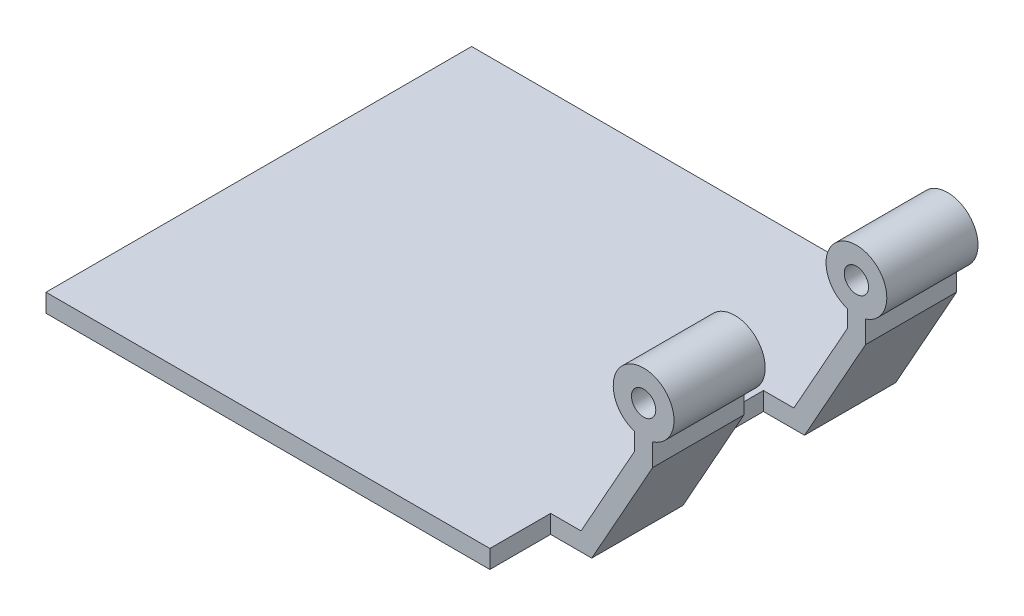
ISO-10303-21;
HEADER;
FILE_DESCRIPTION(('STEP AP214'),'2;1');
FILE_NAME('part.step','',(''),(''),'','','');
FILE_SCHEMA(('AUTOMOTIVE_DESIGN { 1 0 10303 214 1 1 1 1 }'));
ENDSEC;
DATA;
#1=APPLICATION_CONTEXT('core data for automotive mechanical design processes');
#2=APPLICATION_PROTOCOL_DEFINITION('international standard','automotive_design',2000,#1);
#3=PRODUCT_CONTEXT('',#1,'mechanical');
#4=PRODUCT('Part','Part','',(#3));
#5=PRODUCT_RELATED_PRODUCT_CATEGORY('part','',(#4));
#6=PRODUCT_DEFINITION_FORMATION('','',#4);
#7=PRODUCT_DEFINITION_CONTEXT('part definition',#1,'design');
#8=PRODUCT_DEFINITION('design','',#6,#7);
#9=PRODUCT_DEFINITION_SHAPE('','',#8);
#10=(LENGTH_UNIT() NAMED_UNIT(*) SI_UNIT(.MILLI.,.METRE.));
#11=(NAMED_UNIT(*) PLANE_ANGLE_UNIT() SI_UNIT($,.RADIAN.));
#12=(NAMED_UNIT(*) SI_UNIT($,.STERADIAN.) SOLID_ANGLE_UNIT());
#13=UNCERTAINTY_MEASURE_WITH_UNIT(LENGTH_MEASURE(1.E-05),#10,'distance_accuracy_value','');
#14=(GEOMETRIC_REPRESENTATION_CONTEXT(3) GLOBAL_UNCERTAINTY_ASSIGNED_CONTEXT((#13)) GLOBAL_UNIT_ASSIGNED_CONTEXT((#10,
#11,#12)) REPRESENTATION_CONTEXT('',''));
#15=CARTESIAN_POINT('',(0.,0.,0.));
#16=DIRECTION('',(0.,0.,1.));
#17=DIRECTION('',(1.,0.,0.));
#18=AXIS2_PLACEMENT_3D('',#15,#16,#17);
#19=CARTESIAN_POINT('',(90.2917408136151,26.3526404117387,50.));
#20=DIRECTION('',(0.,0.,-1.));
#21=DIRECTION('',(-1.,0.,0.));
#22=AXIS2_PLACEMENT_3D('',#19,#20,#21);
#23=CYLINDRICAL_SURFACE('',#22,5.);
#24=CARTESIAN_POINT('',(90.2917408136151,26.3526404117387,15.));
#25=DIRECTION('',(0.,0.,1.));
#26=DIRECTION('',(0.,-1.,0.));
#27=AXIS2_PLACEMENT_3D('',#24,#25,#26);
#28=CIRCLE('',#27,5.);
#29=CARTESIAN_POINT('',(91.7917408136151,21.582944404654,15.));
#30=VERTEX_POINT('',#29);
#31=CARTESIAN_POINT('',(88.7917408136151,21.582944404654,15.));
#32=VERTEX_POINT('',#31);
#33=EDGE_CURVE('E271',#30,#32,#28,.T.);
#34=ORIENTED_EDGE('',*,*,#33,.F.);
#35=DIRECTION('',(0.,0.,-1.));
#36=VECTOR('',#35,1.);
#37=CARTESIAN_POINT('',(91.7917408136151,21.582944404654,50.));
#38=LINE('',#37,#36);
#39=CARTESIAN_POINT('',(91.7917408136151,21.582944404654,0.));
#40=VERTEX_POINT('',#39);
#41=EDGE_CURVE('E355',#30,#40,#38,.T.);
#42=ORIENTED_EDGE('',*,*,#41,.T.);
#43=CARTESIAN_POINT('',(90.2917408136151,26.3526404117387,0.));
#44=DIRECTION('',(0.,0.,1.));
#45=DIRECTION('',(1.,0.,0.));
#46=AXIS2_PLACEMENT_3D('',#43,#44,#45);
#47=CIRCLE('',#46,5.);
#48=CARTESIAN_POINT('',(88.7917408136151,21.582944404654,0.));
#49=VERTEX_POINT('',#48);
#50=EDGE_CURVE('E299',#40,#49,#47,.T.);
#51=ORIENTED_EDGE('',*,*,#50,.T.);
#52=DIRECTION('',(0.,0.,-1.));
#53=VECTOR('',#52,1.);
#54=CARTESIAN_POINT('',(88.7917408136151,21.582944404654,50.));
#55=LINE('',#54,#53);
#56=EDGE_CURVE('E350',#32,#49,#55,.T.);
#57=ORIENTED_EDGE('',*,*,#56,.F.);
#58=EDGE_LOOP('',(#34,#42,#51,#57));
#59=FACE_BOUND('',#58,.T.);
#60=ADVANCED_FACE('F62',(#59),#23,.T.);
#61=CARTESIAN_POINT('',(90.2917408136151,26.3526404117387,35.));
#62=DIRECTION('',(0.,0.,-1.));
#63=DIRECTION('',(0.,1.,0.));
#64=AXIS2_PLACEMENT_3D('',#61,#62,#63);
#65=CIRCLE('',#64,5.);
#66=CARTESIAN_POINT('',(88.7917408136151,21.582944404654,35.));
#67=VERTEX_POINT('',#66);
#68=CARTESIAN_POINT('',(91.7917408136151,21.582944404654,35.));
#69=VERTEX_POINT('',#68);
#70=EDGE_CURVE('E285',#67,#69,#65,.T.);
#71=ORIENTED_EDGE('',*,*,#70,.F.);
#72=CARTESIAN_POINT('',(88.7917408136151,21.582944404654,50.));
#73=VERTEX_POINT('',#72);
#74=EDGE_CURVE('E76',#73,#67,#55,.T.);
#75=ORIENTED_EDGE('',*,*,#74,.F.);
#76=CARTESIAN_POINT('',(90.2917408136151,26.3526404117387,50.));
#77=DIRECTION('',(0.,0.,1.));
#78=DIRECTION('',(1.,0.,0.));
#79=AXIS2_PLACEMENT_3D('',#76,#77,#78);
#80=CIRCLE('',#79,5.);
#81=CARTESIAN_POINT('',(91.7917408136151,21.582944404654,50.));
#82=VERTEX_POINT('',#81);
#83=EDGE_CURVE('E322',#82,#73,#80,.T.);
#84=ORIENTED_EDGE('',*,*,#83,.F.);
#85=EDGE_CURVE('E69',#82,#69,#38,.T.);
#86=ORIENTED_EDGE('',*,*,#85,.T.);
#87=EDGE_LOOP('',(#71,#75,#84,#86));
#88=FACE_BOUND('',#87,.T.);
#89=ADVANCED_FACE('F364',(#88),#23,.T.);
#90=CARTESIAN_POINT('',(110.015744072677,30.0086373562634,35.));
#91=DIRECTION('',(0.,0.,-1.));
#92=DIRECTION('',(0.,1.,0.));
#93=AXIS2_PLACEMENT_3D('',#90,#91,#92);
#94=PLANE('',#93);
#95=DIRECTION('',(-0.488430045200838,-0.872603054627422,0.));
#96=VECTOR('',#95,1.);
#97=CARTESIAN_POINT('',(81.7587720513456,0.,35.));
#98=LINE('',#97,#96);
#99=CARTESIAN_POINT('',(91.7917408136151,17.9243666006214,35.));
#100=VERTEX_POINT('',#99);
#101=CARTESIAN_POINT('',(81.7587720513456,0.,35.));
#102=VERTEX_POINT('',#101);
#103=EDGE_CURVE('E217',#100,#102,#98,.T.);
#104=ORIENTED_EDGE('',*,*,#103,.T.);
#105=DIRECTION('',(1.,0.,0.));
#106=VECTOR('',#105,1.);
#107=CARTESIAN_POINT('',(75.,0.,35.));
#108=LINE('',#107,#106);
#109=CARTESIAN_POINT('',(75.,0.,35.));
#110=VERTEX_POINT('',#109);
#111=EDGE_CURVE('E213',#110,#102,#108,.T.);
#112=ORIENTED_EDGE('',*,*,#111,.F.);
#113=DIRECTION('',(0.,1.,0.));
#114=VECTOR('',#113,1.);
#115=CARTESIAN_POINT('',(75.,0.,35.));
#116=LINE('',#115,#114);
#117=CARTESIAN_POINT('',(75.,3.,35.));
#118=VERTEX_POINT('',#117);
#119=EDGE_CURVE('E198',#110,#118,#116,.T.);
#120=ORIENTED_EDGE('',*,*,#119,.T.);
#121=DIRECTION('',(1.,0.,0.));
#122=VECTOR('',#121,1.);
#123=CARTESIAN_POINT('',(75.,3.,35.));
#124=LINE('',#123,#122);
#125=CARTESIAN_POINT('',(80.,3.,35.));
#126=VERTEX_POINT('',#125);
#127=EDGE_CURVE('E226',#118,#126,#124,.T.);
#128=ORIENTED_EDGE('',*,*,#127,.T.);
#129=DIRECTION('',(0.488430045200838,0.872603054627422,0.));
#130=VECTOR('',#129,1.);
#131=CARTESIAN_POINT('',(88.7917408136151,18.7068549832936,35.));
#132=LINE('',#131,#130);
#133=CARTESIAN_POINT('',(88.7917408136151,18.7068549832936,35.));
#134=VERTEX_POINT('',#133);
#135=EDGE_CURVE('E288',#126,#134,#132,.T.);
#136=ORIENTED_EDGE('',*,*,#135,.T.);
#137=DIRECTION('',(0.,-1.,0.));
#138=VECTOR('',#137,1.);
#139=CARTESIAN_POINT('',(88.7917408136151,18.7068549832936,35.));
#140=LINE('',#139,#138);
#141=EDGE_CURVE('E289',#67,#134,#140,.T.);
#142=ORIENTED_EDGE('',*,*,#141,.F.);
#143=ORIENTED_EDGE('',*,*,#70,.T.);
#144=DIRECTION('',(0.,-1.,0.));
#145=VECTOR('',#144,1.);
#146=CARTESIAN_POINT('',(91.7917408136151,17.9243666006214,35.));
#147=LINE('',#146,#145);
#148=EDGE_CURVE('E287',#69,#100,#147,.T.);
#149=ORIENTED_EDGE('',*,*,#148,.T.);
#150=EDGE_LOOP('',(#104,#112,#120,#128,#136,#142,#143,#149));
#151=FACE_BOUND('',#150,.T.);
#152=CARTESIAN_POINT('',(90.2917408136151,26.3526404117387,35.));
#153=DIRECTION('',(0.,0.,-1.));
#154=DIRECTION('',(0.,1.,0.));
#155=AXIS2_PLACEMENT_3D('',#152,#153,#154);
#156=CIRCLE('',#155,2.);
#157=CARTESIAN_POINT('',(90.2917408136151,28.3526404117387,35.));
#158=VERTEX_POINT('',#157);
#159=EDGE_CURVE('E284',#158,#158,#156,.T.);
#160=ORIENTED_EDGE('',*,*,#159,.F.);
#161=EDGE_LOOP('',(#160));
#162=FACE_BOUND('',#161,.T.);
#163=ADVANCED_FACE('F214',(#151,#162),#94,.T.);
#164=CARTESIAN_POINT('',(110.015744072677,30.0086373562634,15.));
#165=DIRECTION('',(0.,0.,1.));
#166=DIRECTION('',(0.,-1.,0.));
#167=AXIS2_PLACEMENT_3D('',#164,#165,#166);
#168=PLANE('',#167);
#169=DIRECTION('',(-1.,0.,0.));
#170=VECTOR('',#169,1.);
#171=CARTESIAN_POINT('',(75.,0.,15.));
#172=LINE('',#171,#170);
#173=CARTESIAN_POINT('',(81.7587720513456,0.,15.));
#174=VERTEX_POINT('',#173);
#175=CARTESIAN_POINT('',(75.,0.,15.));
#176=VERTEX_POINT('',#175);
#177=EDGE_CURVE('E210',#174,#176,#172,.T.);
#178=ORIENTED_EDGE('',*,*,#177,.F.);
#179=DIRECTION('',(0.488430045200838,0.872603054627422,0.));
#180=VECTOR('',#179,1.);
#181=CARTESIAN_POINT('',(81.7587720513456,0.,15.));
#182=LINE('',#181,#180);
#183=CARTESIAN_POINT('',(91.7917408136151,17.9243666006214,15.));
#184=VERTEX_POINT('',#183);
#185=EDGE_CURVE('E274',#174,#184,#182,.T.);
#186=ORIENTED_EDGE('',*,*,#185,.T.);
#187=DIRECTION('',(0.,1.,0.));
#188=VECTOR('',#187,1.);
#189=CARTESIAN_POINT('',(91.7917408136151,17.9243666006214,15.));
#190=LINE('',#189,#188);
#191=EDGE_CURVE('E275',#184,#30,#190,.T.);
#192=ORIENTED_EDGE('',*,*,#191,.T.);
#193=ORIENTED_EDGE('',*,*,#33,.T.);
#194=DIRECTION('',(0.,1.,0.));
#195=VECTOR('',#194,1.);
#196=CARTESIAN_POINT('',(88.7917408136151,18.7068549832936,15.));
#197=LINE('',#196,#195);
#198=CARTESIAN_POINT('',(88.7917408136151,18.7068549832936,15.));
#199=VERTEX_POINT('',#198);
#200=EDGE_CURVE('E273',#199,#32,#197,.T.);
#201=ORIENTED_EDGE('',*,*,#200,.F.);
#202=DIRECTION('',(-0.488430045200838,-0.872603054627422,0.));
#203=VECTOR('',#202,1.);
#204=CARTESIAN_POINT('',(88.7917408136151,18.7068549832936,15.));
#205=LINE('',#204,#203);
#206=CARTESIAN_POINT('',(80.,3.,15.));
#207=VERTEX_POINT('',#206);
#208=EDGE_CURVE('E281',#199,#207,#205,.T.);
#209=ORIENTED_EDGE('',*,*,#208,.T.);
#210=DIRECTION('',(-1.,0.,0.));
#211=VECTOR('',#210,1.);
#212=CARTESIAN_POINT('',(75.,3.,15.));
#213=LINE('',#212,#211);
#214=CARTESIAN_POINT('',(75.,3.,15.));
#215=VERTEX_POINT('',#214);
#216=EDGE_CURVE('E224',#207,#215,#213,.T.);
#217=ORIENTED_EDGE('',*,*,#216,.T.);
#218=DIRECTION('',(0.,1.,0.));
#219=VECTOR('',#218,1.);
#220=CARTESIAN_POINT('',(75.,0.,15.));
#221=LINE('',#220,#219);
#222=EDGE_CURVE('E209',#176,#215,#221,.T.);
#223=ORIENTED_EDGE('',*,*,#222,.F.);
#224=EDGE_LOOP('',(#178,#186,#192,#193,#201,#209,#217,#223));
#225=FACE_BOUND('',#224,.T.);
#226=CARTESIAN_POINT('',(90.2917408136151,26.3526404117387,15.));
#227=DIRECTION('',(0.,0.,1.));
#228=DIRECTION('',(0.,-1.,0.));
#229=AXIS2_PLACEMENT_3D('',#226,#227,#228);
#230=CIRCLE('',#229,2.);
#231=CARTESIAN_POINT('',(90.2917408136151,24.3526404117387,15.));
#232=VERTEX_POINT('',#231);
#233=EDGE_CURVE('E270',#232,#232,#230,.T.);
#234=ORIENTED_EDGE('',*,*,#233,.F.);
#235=EDGE_LOOP('',(#234));
#236=FACE_BOUND('',#235,.T.);
#237=ADVANCED_FACE('F363',(#225,#236),#168,.T.);
#238=CARTESIAN_POINT('',(88.7917408136151,18.7068549832936,50.));
#239=DIRECTION('',(-1.,0.,0.));
#240=DIRECTION('',(0.,0.,1.));
#241=AXIS2_PLACEMENT_3D('',#238,#239,#240);
#242=PLANE('',#241);
#243=ORIENTED_EDGE('',*,*,#74,.T.);
#244=ORIENTED_EDGE('',*,*,#141,.T.);
#245=DIRECTION('',(0.,0.,-1.));
#246=VECTOR('',#245,1.);
#247=CARTESIAN_POINT('',(88.7917408136151,18.7068549832936,50.));
#248=LINE('',#247,#246);
#249=CARTESIAN_POINT('',(88.7917408136151,18.7068549832936,50.));
#250=VERTEX_POINT('',#249);
#251=EDGE_CURVE('E340',#250,#134,#248,.T.);
#252=ORIENTED_EDGE('',*,*,#251,.F.);
#253=DIRECTION('',(0.,1.,0.));
#254=VECTOR('',#253,1.);
#255=CARTESIAN_POINT('',(88.7917408136151,18.7068549832936,50.));
#256=LINE('',#255,#254);
#257=EDGE_CURVE('E310',#250,#73,#256,.T.);
#258=ORIENTED_EDGE('',*,*,#257,.T.);
#259=EDGE_LOOP('',(#243,#244,#252,#258));
#260=FACE_BOUND('',#259,.T.);
#261=ADVANCED_FACE('F370',(#260),#242,.T.);
#262=CARTESIAN_POINT('',(88.7917408136151,18.7068549832936,0.));
#263=VERTEX_POINT('',#262);
#264=EDGE_CURVE('E339',#199,#263,#248,.T.);
#265=ORIENTED_EDGE('',*,*,#264,.F.);
#266=ORIENTED_EDGE('',*,*,#200,.T.);
#267=ORIENTED_EDGE('',*,*,#56,.T.);
#268=DIRECTION('',(0.,1.,0.));
#269=VECTOR('',#268,1.);
#270=CARTESIAN_POINT('',(88.7917408136151,18.7068549832936,0.));
#271=LINE('',#270,#269);
#272=EDGE_CURVE('E328',#263,#49,#271,.T.);
#273=ORIENTED_EDGE('',*,*,#272,.F.);
#274=EDGE_LOOP('',(#265,#266,#267,#273));
#275=FACE_BOUND('',#274,.T.);
#276=ADVANCED_FACE('F398',(#275),#242,.T.);
#277=CARTESIAN_POINT('',(88.7917408136151,18.7068549832936,50.));
#278=DIRECTION('',(0.872603054627422,-0.488430045200838,0.));
#279=DIRECTION('',(0.488430045200838,0.872603054627422,0.));
#280=AXIS2_PLACEMENT_3D('',#277,#278,#279);
#281=PLANE('',#280);
#282=ORIENTED_EDGE('',*,*,#135,.F.);
#283=DIRECTION('',(0.,0.,-1.));
#284=VECTOR('',#283,1.);
#285=CARTESIAN_POINT('',(80.,3.,50.));
#286=LINE('',#285,#284);
#287=CARTESIAN_POINT('',(80.,3.,50.));
#288=VERTEX_POINT('',#287);
#289=EDGE_CURVE('E336',#288,#126,#286,.T.);
#290=ORIENTED_EDGE('',*,*,#289,.F.);
#291=DIRECTION('',(-0.488430045200838,-0.872603054627422,0.));
#292=VECTOR('',#291,1.);
#293=CARTESIAN_POINT('',(88.7917408136151,18.7068549832936,50.));
#294=LINE('',#293,#292);
#295=EDGE_CURVE('E313',#250,#288,#294,.T.);
#296=ORIENTED_EDGE('',*,*,#295,.F.);
#297=ORIENTED_EDGE('',*,*,#251,.T.);
#298=EDGE_LOOP('',(#282,#290,#296,#297));
#299=FACE_BOUND('',#298,.T.);
#300=ADVANCED_FACE('F437',(#299),#281,.F.);
#301=ORIENTED_EDGE('',*,*,#208,.F.);
#302=ORIENTED_EDGE('',*,*,#264,.T.);
#303=DIRECTION('',(-0.488430045200838,-0.872603054627422,0.));
#304=VECTOR('',#303,1.);
#305=CARTESIAN_POINT('',(88.7917408136151,18.7068549832936,0.));
#306=LINE('',#305,#304);
#307=CARTESIAN_POINT('',(80.,3.,0.));
#308=VERTEX_POINT('',#307);
#309=EDGE_CURVE('E331',#263,#308,#306,.T.);
#310=ORIENTED_EDGE('',*,*,#309,.T.);
#311=EDGE_CURVE('E318',#207,#308,#286,.T.);
#312=ORIENTED_EDGE('',*,*,#311,.F.);
#313=EDGE_LOOP('',(#301,#302,#310,#312));
#314=FACE_BOUND('',#313,.T.);
#315=ADVANCED_FACE('F402',(#314),#281,.F.);
#316=CARTESIAN_POINT('',(80.,3.,50.));
#317=DIRECTION('',(0.,-1.,0.));
#318=DIRECTION('',(1.,0.,0.));
#319=AXIS2_PLACEMENT_3D('',#316,#317,#318);
#320=PLANE('',#319);
#321=DIRECTION('',(0.,0.,1.));
#322=VECTOR('',#321,1.);
#323=CARTESIAN_POINT('',(75.,3.,15.));
#324=LINE('',#323,#322);
#325=EDGE_CURVE('E206',#215,#118,#324,.T.);
#326=ORIENTED_EDGE('',*,*,#325,.F.);
#327=ORIENTED_EDGE('',*,*,#216,.F.);
#328=ORIENTED_EDGE('',*,*,#311,.T.);
#329=DIRECTION('',(-1.,0.,0.));
#330=VECTOR('',#329,1.);
#331=CARTESIAN_POINT('',(80.,3.,0.));
#332=LINE('',#331,#330);
#333=CARTESIAN_POINT('',(75.,3.,0.));
#334=VERTEX_POINT('',#333);
#335=EDGE_CURVE('E305',#308,#334,#332,.T.);
#336=ORIENTED_EDGE('',*,*,#335,.T.);
#337=DIRECTION('',(0.,0.,-1.));
#338=VECTOR('',#337,1.);
#339=CARTESIAN_POINT('',(75.,3.,-10.));
#340=LINE('',#339,#338);
#341=CARTESIAN_POINT('',(75.,3.,-10.));
#342=VERTEX_POINT('',#341);
#343=EDGE_CURVE('E253',#334,#342,#340,.T.);
#344=ORIENTED_EDGE('',*,*,#343,.T.);
#345=DIRECTION('',(-1.,0.,0.));
#346=VECTOR('',#345,1.);
#347=CARTESIAN_POINT('',(2.,2.99999999999999,-10.));
#348=LINE('',#347,#346);
#349=CARTESIAN_POINT('',(2.,2.99999999999999,-10.));
#350=VERTEX_POINT('',#349);
#351=EDGE_CURVE('E238',#342,#350,#348,.T.);
#352=ORIENTED_EDGE('',*,*,#351,.T.);
#353=DIRECTION('',(0.,0.,1.));
#354=VECTOR('',#353,1.);
#355=CARTESIAN_POINT('',(2.,2.99999999999999,-10.));
#356=LINE('',#355,#354);
#357=CARTESIAN_POINT('',(2.,2.99999999999999,60.));
#358=VERTEX_POINT('',#357);
#359=EDGE_CURVE('E232',#350,#358,#356,.T.);
#360=ORIENTED_EDGE('',*,*,#359,.T.);
#361=DIRECTION('',(1.,0.,0.));
#362=VECTOR('',#361,1.);
#363=CARTESIAN_POINT('',(2.,2.99999999999999,60.));
#364=LINE('',#363,#362);
#365=CARTESIAN_POINT('',(75.,3.,60.));
#366=VERTEX_POINT('',#365);
#367=EDGE_CURVE('E250',#358,#366,#364,.T.);
#368=ORIENTED_EDGE('',*,*,#367,.T.);
#369=CARTESIAN_POINT('',(75.,3.,50.));
#370=VERTEX_POINT('',#369);
#371=EDGE_CURVE('E254',#366,#370,#340,.T.);
#372=ORIENTED_EDGE('',*,*,#371,.T.);
#373=DIRECTION('',(-1.,0.,0.));
#374=VECTOR('',#373,1.);
#375=CARTESIAN_POINT('',(80.,3.,50.));
#376=LINE('',#375,#374);
#377=EDGE_CURVE('E315',#288,#370,#376,.T.);
#378=ORIENTED_EDGE('',*,*,#377,.F.);
#379=ORIENTED_EDGE('',*,*,#289,.T.);
#380=ORIENTED_EDGE('',*,*,#127,.F.);
#381=EDGE_LOOP('',(#326,#327,#328,#336,#344,#352,#360,#368,#372,#378,#379,#380));
#382=FACE_BOUND('',#381,.T.);
#383=ADVANCED_FACE('F404',(#382),#320,.F.);
#384=CARTESIAN_POINT('',(81.7587720513456,0.,50.));
#385=DIRECTION('',(-0.872603054627422,0.488430045200838,0.));
#386=DIRECTION('',(-0.488430045200838,-0.872603054627422,0.));
#387=AXIS2_PLACEMENT_3D('',#384,#385,#386);
#388=PLANE('',#387);
#389=ORIENTED_EDGE('',*,*,#103,.F.);
#390=DIRECTION('',(0.,0.,-1.));
#391=VECTOR('',#390,1.);
#392=CARTESIAN_POINT('',(91.7917408136151,17.9243666006214,50.));
#393=LINE('',#392,#391);
#394=CARTESIAN_POINT('',(91.7917408136151,17.9243666006214,50.));
#395=VERTEX_POINT('',#394);
#396=EDGE_CURVE('E344',#395,#100,#393,.T.);
#397=ORIENTED_EDGE('',*,*,#396,.F.);
#398=DIRECTION('',(0.488430045200838,0.872603054627422,0.));
#399=VECTOR('',#398,1.);
#400=CARTESIAN_POINT('',(81.7587720513456,0.,50.));
#401=LINE('',#400,#399);
#402=CARTESIAN_POINT('',(81.7587720513456,0.,50.));
#403=VERTEX_POINT('',#402);
#404=EDGE_CURVE('E304',#403,#395,#401,.T.);
#405=ORIENTED_EDGE('',*,*,#404,.F.);
#406=DIRECTION('',(0.,0.,-1.));
#407=VECTOR('',#406,1.);
#408=CARTESIAN_POINT('',(81.7587720513456,0.,50.));
#409=LINE('',#408,#407);
#410=EDGE_CURVE('E348',#403,#102,#409,.T.);
#411=ORIENTED_EDGE('',*,*,#410,.T.);
#412=EDGE_LOOP('',(#389,#397,#405,#411));
#413=FACE_BOUND('',#412,.T.);
#414=ADVANCED_FACE('F451',(#413),#388,.F.);
#415=ORIENTED_EDGE('',*,*,#185,.F.);
#416=CARTESIAN_POINT('',(81.7587720513456,0.,0.));
#417=VERTEX_POINT('',#416);
#418=EDGE_CURVE('E347',#174,#417,#409,.T.);
#419=ORIENTED_EDGE('',*,*,#418,.T.);
#420=DIRECTION('',(0.488430045200838,0.872603054627422,0.));
#421=VECTOR('',#420,1.);
#422=CARTESIAN_POINT('',(81.7587720513456,0.,0.));
#423=LINE('',#422,#421);
#424=CARTESIAN_POINT('',(91.7917408136151,17.9243666006214,0.));
#425=VERTEX_POINT('',#424);
#426=EDGE_CURVE('E321',#417,#425,#423,.T.);
#427=ORIENTED_EDGE('',*,*,#426,.T.);
#428=EDGE_CURVE('E343',#184,#425,#393,.T.);
#429=ORIENTED_EDGE('',*,*,#428,.F.);
#430=EDGE_LOOP('',(#415,#419,#427,#429));
#431=FACE_BOUND('',#430,.T.);
#432=ADVANCED_FACE('F407',(#431),#388,.F.);
#433=CARTESIAN_POINT('',(91.7917408136151,17.9243666006214,50.));
#434=DIRECTION('',(-1.,0.,0.));
#435=DIRECTION('',(0.,0.,1.));
#436=AXIS2_PLACEMENT_3D('',#433,#434,#435);
#437=PLANE('',#436);
#438=ORIENTED_EDGE('',*,*,#148,.F.);
#439=ORIENTED_EDGE('',*,*,#85,.F.);
#440=DIRECTION('',(0.,1.,0.));
#441=VECTOR('',#440,1.);
#442=CARTESIAN_POINT('',(91.7917408136151,17.9243666006214,50.));
#443=LINE('',#442,#441);
#444=EDGE_CURVE('E307',#395,#82,#443,.T.);
#445=ORIENTED_EDGE('',*,*,#444,.F.);
#446=ORIENTED_EDGE('',*,*,#396,.T.);
#447=EDGE_LOOP('',(#438,#439,#445,#446));
#448=FACE_BOUND('',#447,.T.);
#449=ADVANCED_FACE('F448',(#448),#437,.F.);
#450=ORIENTED_EDGE('',*,*,#191,.F.);
#451=ORIENTED_EDGE('',*,*,#428,.T.);
#452=DIRECTION('',(0.,1.,0.));
#453=VECTOR('',#452,1.);
#454=CARTESIAN_POINT('',(91.7917408136151,17.9243666006214,0.));
#455=LINE('',#454,#453);
#456=EDGE_CURVE('E325',#425,#40,#455,.T.);
#457=ORIENTED_EDGE('',*,*,#456,.T.);
#458=ORIENTED_EDGE('',*,*,#41,.F.);
#459=EDGE_LOOP('',(#450,#451,#457,#458));
#460=FACE_BOUND('',#459,.T.);
#461=ADVANCED_FACE('F386',(#460),#437,.F.);
#462=CARTESIAN_POINT('',(90.2917408136151,26.3526404117387,50.));
#463=DIRECTION('',(0.,0.,-1.));
#464=DIRECTION('',(-1.,0.,0.));
#465=AXIS2_PLACEMENT_3D('',#462,#463,#464);
#466=CYLINDRICAL_SURFACE('',#465,2.);
#467=CARTESIAN_POINT('',(90.2917408136151,26.3526404117387,50.));
#468=DIRECTION('',(0.,0.,1.));
#469=DIRECTION('',(1.,0.,0.));
#470=AXIS2_PLACEMENT_3D('',#467,#468,#469);
#471=CIRCLE('',#470,2.);
#472=CARTESIAN_POINT('',(92.2917408136151,26.3526404117387,50.));
#473=VERTEX_POINT('',#472);
#474=EDGE_CURVE('E296',#473,#473,#471,.T.);
#475=ORIENTED_EDGE('',*,*,#474,.T.);
#476=EDGE_LOOP('',(#475));
#477=FACE_BOUND('',#476,.T.);
#478=ORIENTED_EDGE('',*,*,#159,.T.);
#479=EDGE_LOOP('',(#478));
#480=FACE_BOUND('',#479,.T.);
#481=ADVANCED_FACE('F361',(#477,#480),#466,.F.);
#482=CARTESIAN_POINT('',(90.2917408136151,26.3526404117387,0.));
#483=DIRECTION('',(0.,0.,1.));
#484=DIRECTION('',(1.,0.,0.));
#485=AXIS2_PLACEMENT_3D('',#482,#483,#484);
#486=CIRCLE('',#485,2.);
#487=CARTESIAN_POINT('',(92.2917408136151,26.3526404117387,0.));
#488=VERTEX_POINT('',#487);
#489=EDGE_CURVE('E295',#488,#488,#486,.T.);
#490=ORIENTED_EDGE('',*,*,#489,.F.);
#491=EDGE_LOOP('',(#490));
#492=FACE_BOUND('',#491,.T.);
#493=ORIENTED_EDGE('',*,*,#233,.T.);
#494=EDGE_LOOP('',(#493));
#495=FACE_BOUND('',#494,.T.);
#496=ADVANCED_FACE('F455',(#492,#495),#466,.F.);
#497=CARTESIAN_POINT('',(0.,0.,50.));
#498=DIRECTION('',(0.,1.,0.));
#499=DIRECTION('',(0.,0.,1.));
#500=AXIS2_PLACEMENT_3D('',#497,#498,#499);
#501=PLANE('',#500);
#502=ORIENTED_EDGE('',*,*,#418,.F.);
#503=ORIENTED_EDGE('',*,*,#177,.T.);
#504=DIRECTION('',(0.,0.,1.));
#505=VECTOR('',#504,1.);
#506=CARTESIAN_POINT('',(75.,0.,15.));
#507=LINE('',#506,#505);
#508=EDGE_CURVE('E203',#176,#110,#507,.T.);
#509=ORIENTED_EDGE('',*,*,#508,.T.);
#510=ORIENTED_EDGE('',*,*,#111,.T.);
#511=ORIENTED_EDGE('',*,*,#410,.F.);
#512=DIRECTION('',(1.,0.,0.));
#513=VECTOR('',#512,1.);
#514=CARTESIAN_POINT('',(0.,0.,50.));
#515=LINE('',#514,#513);
#516=CARTESIAN_POINT('',(75.,0.,50.));
#517=VERTEX_POINT('',#516);
#518=EDGE_CURVE('E302',#517,#403,#515,.T.);
#519=ORIENTED_EDGE('',*,*,#518,.F.);
#520=DIRECTION('',(0.,0.,-1.));
#521=VECTOR('',#520,1.);
#522=CARTESIAN_POINT('',(75.,0.,-10.));
#523=LINE('',#522,#521);
#524=CARTESIAN_POINT('',(75.,0.,60.));
#525=VERTEX_POINT('',#524);
#526=EDGE_CURVE('E242',#525,#517,#523,.T.);
#527=ORIENTED_EDGE('',*,*,#526,.F.);
#528=DIRECTION('',(1.,0.,0.));
#529=VECTOR('',#528,1.);
#530=CARTESIAN_POINT('',(2.,0.,60.));
#531=LINE('',#530,#529);
#532=CARTESIAN_POINT('',(2.,0.,60.));
#533=VERTEX_POINT('',#532);
#534=EDGE_CURVE('E237',#533,#525,#531,.T.);
#535=ORIENTED_EDGE('',*,*,#534,.F.);
#536=DIRECTION('',(0.,0.,1.));
#537=VECTOR('',#536,1.);
#538=CARTESIAN_POINT('',(2.,0.,-10.));
#539=LINE('',#538,#537);
#540=CARTESIAN_POINT('',(2.,0.,-10.));
#541=VERTEX_POINT('',#540);
#542=EDGE_CURVE('E234',#541,#533,#539,.T.);
#543=ORIENTED_EDGE('',*,*,#542,.F.);
#544=DIRECTION('',(-1.,0.,0.));
#545=VECTOR('',#544,1.);
#546=CARTESIAN_POINT('',(2.,0.,-10.));
#547=LINE('',#546,#545);
#548=CARTESIAN_POINT('',(75.,0.,-10.));
#549=VERTEX_POINT('',#548);
#550=EDGE_CURVE('E244',#549,#541,#547,.T.);
#551=ORIENTED_EDGE('',*,*,#550,.F.);
#552=CARTESIAN_POINT('',(75.,0.,0.));
#553=VERTEX_POINT('',#552);
#554=EDGE_CURVE('E241',#553,#549,#523,.T.);
#555=ORIENTED_EDGE('',*,*,#554,.F.);
#556=DIRECTION('',(1.,0.,0.));
#557=VECTOR('',#556,1.);
#558=CARTESIAN_POINT('',(0.,0.,0.));
#559=LINE('',#558,#557);
#560=EDGE_CURVE('E319',#553,#417,#559,.T.);
#561=ORIENTED_EDGE('',*,*,#560,.T.);
#562=EDGE_LOOP('',(#502,#503,#509,#510,#511,#519,#527,#535,#543,#551,#555,#561));
#563=FACE_BOUND('',#562,.T.);
#564=ADVANCED_FACE('F223',(#563),#501,.F.);
#565=CARTESIAN_POINT('',(0.,0.,0.));
#566=DIRECTION('',(0.,0.,1.));
#567=DIRECTION('',(1.,0.,0.));
#568=AXIS2_PLACEMENT_3D('',#565,#566,#567);
#569=PLANE('',#568);
#570=ORIENTED_EDGE('',*,*,#560,.F.);
#571=DIRECTION('',(0.,1.,0.));
#572=VECTOR('',#571,1.);
#573=CARTESIAN_POINT('',(75.,0.,0.));
#574=LINE('',#573,#572);
#575=EDGE_CURVE('E261',#553,#334,#574,.T.);
#576=ORIENTED_EDGE('',*,*,#575,.T.);
#577=ORIENTED_EDGE('',*,*,#335,.F.);
#578=ORIENTED_EDGE('',*,*,#309,.F.);
#579=ORIENTED_EDGE('',*,*,#272,.T.);
#580=ORIENTED_EDGE('',*,*,#50,.F.);
#581=ORIENTED_EDGE('',*,*,#456,.F.);
#582=ORIENTED_EDGE('',*,*,#426,.F.);
#583=EDGE_LOOP('',(#570,#576,#577,#578,#579,#580,#581,#582));
#584=FACE_BOUND('',#583,.T.);
#585=ORIENTED_EDGE('',*,*,#489,.T.);
#586=EDGE_LOOP('',(#585));
#587=FACE_BOUND('',#586,.T.);
#588=ADVANCED_FACE('F391',(#584,#587),#569,.F.);
#589=CARTESIAN_POINT('',(0.,0.,50.));
#590=DIRECTION('',(0.,0.,1.));
#591=DIRECTION('',(1.,0.,0.));
#592=AXIS2_PLACEMENT_3D('',#589,#590,#591);
#593=PLANE('',#592);
#594=DIRECTION('',(0.,1.,0.));
#595=VECTOR('',#594,1.);
#596=CARTESIAN_POINT('',(75.,0.,50.));
#597=LINE('',#596,#595);
#598=EDGE_CURVE('E12',#517,#370,#597,.T.);
#599=ORIENTED_EDGE('',*,*,#598,.F.);
#600=ORIENTED_EDGE('',*,*,#518,.T.);
#601=ORIENTED_EDGE('',*,*,#404,.T.);
#602=ORIENTED_EDGE('',*,*,#444,.T.);
#603=ORIENTED_EDGE('',*,*,#83,.T.);
#604=ORIENTED_EDGE('',*,*,#257,.F.);
#605=ORIENTED_EDGE('',*,*,#295,.T.);
#606=ORIENTED_EDGE('',*,*,#377,.T.);
#607=EDGE_LOOP('',(#599,#600,#601,#602,#603,#604,#605,#606));
#608=FACE_BOUND('',#607,.T.);
#609=ORIENTED_EDGE('',*,*,#474,.F.);
#610=EDGE_LOOP('',(#609));
#611=FACE_BOUND('',#610,.T.);
#612=ADVANCED_FACE('F429',(#608,#611),#593,.T.);
#613=CARTESIAN_POINT('',(75.,0.,-10.));
#614=DIRECTION('',(1.,0.,0.));
#615=DIRECTION('',(0.,0.,-1.));
#616=AXIS2_PLACEMENT_3D('',#613,#614,#615);
#617=PLANE('',#616);
#618=ORIENTED_EDGE('',*,*,#575,.F.);
#619=ORIENTED_EDGE('',*,*,#554,.T.);
#620=DIRECTION('',(0.,1.,0.));
#621=VECTOR('',#620,1.);
#622=CARTESIAN_POINT('',(75.,0.,-10.));
#623=LINE('',#622,#621);
#624=EDGE_CURVE('E262',#549,#342,#623,.T.);
#625=ORIENTED_EDGE('',*,*,#624,.T.);
#626=ORIENTED_EDGE('',*,*,#343,.F.);
#627=EDGE_LOOP('',(#618,#619,#625,#626));
#628=FACE_BOUND('',#627,.T.);
#629=ADVANCED_FACE('F411',(#628),#617,.T.);
#630=CARTESIAN_POINT('',(2.,0.,-10.));
#631=DIRECTION('',(-1.,0.,0.));
#632=DIRECTION('',(0.,0.,1.));
#633=AXIS2_PLACEMENT_3D('',#630,#631,#632);
#634=PLANE('',#633);
#635=ORIENTED_EDGE('',*,*,#359,.F.);
#636=DIRECTION('',(0.,1.,0.));
#637=VECTOR('',#636,1.);
#638=CARTESIAN_POINT('',(2.,0.,-10.));
#639=LINE('',#638,#637);
#640=EDGE_CURVE('E259',#541,#350,#639,.T.);
#641=ORIENTED_EDGE('',*,*,#640,.F.);
#642=ORIENTED_EDGE('',*,*,#542,.T.);
#643=DIRECTION('',(0.,1.,0.));
#644=VECTOR('',#643,1.);
#645=CARTESIAN_POINT('',(2.,0.,60.));
#646=LINE('',#645,#644);
#647=EDGE_CURVE('E247',#533,#358,#646,.T.);
#648=ORIENTED_EDGE('',*,*,#647,.T.);
#649=EDGE_LOOP('',(#635,#641,#642,#648));
#650=FACE_BOUND('',#649,.T.);
#651=ADVANCED_FACE('F419',(#650),#634,.T.);
#652=CARTESIAN_POINT('',(2.,0.,-10.));
#653=DIRECTION('',(0.,0.,-1.));
#654=DIRECTION('',(-1.,0.,0.));
#655=AXIS2_PLACEMENT_3D('',#652,#653,#654);
#656=PLANE('',#655);
#657=ORIENTED_EDGE('',*,*,#351,.F.);
#658=ORIENTED_EDGE('',*,*,#624,.F.);
#659=ORIENTED_EDGE('',*,*,#550,.T.);
#660=ORIENTED_EDGE('',*,*,#640,.T.);
#661=EDGE_LOOP('',(#657,#658,#659,#660));
#662=FACE_BOUND('',#661,.T.);
#663=ADVANCED_FACE('F416',(#662),#656,.T.);
#664=ORIENTED_EDGE('',*,*,#526,.T.);
#665=ORIENTED_EDGE('',*,*,#598,.T.);
#666=ORIENTED_EDGE('',*,*,#371,.F.);
#667=DIRECTION('',(0.,1.,0.));
#668=VECTOR('',#667,1.);
#669=CARTESIAN_POINT('',(75.,0.,60.));
#670=LINE('',#669,#668);
#671=EDGE_CURVE('E265',#525,#366,#670,.T.);
#672=ORIENTED_EDGE('',*,*,#671,.F.);
#673=EDGE_LOOP('',(#664,#665,#666,#672));
#674=FACE_BOUND('',#673,.T.);
#675=ADVANCED_FACE('F527',(#674),#617,.T.);
#676=CARTESIAN_POINT('',(2.,0.,60.));
#677=DIRECTION('',(0.,0.,1.));
#678=DIRECTION('',(1.,0.,0.));
#679=AXIS2_PLACEMENT_3D('',#676,#677,#678);
#680=PLANE('',#679);
#681=ORIENTED_EDGE('',*,*,#367,.F.);
#682=ORIENTED_EDGE('',*,*,#647,.F.);
#683=ORIENTED_EDGE('',*,*,#534,.T.);
#684=ORIENTED_EDGE('',*,*,#671,.T.);
#685=EDGE_LOOP('',(#681,#682,#683,#684));
#686=FACE_BOUND('',#685,.T.);
#687=ADVANCED_FACE('F423',(#686),#680,.T.);
#688=CARTESIAN_POINT('',(75.,0.,15.));
#689=DIRECTION('',(-1.,0.,0.));
#690=DIRECTION('',(0.,-1.,0.));
#691=AXIS2_PLACEMENT_3D('',#688,#689,#690);
#692=PLANE('',#691);
#693=ORIENTED_EDGE('',*,*,#325,.T.);
#694=ORIENTED_EDGE('',*,*,#119,.F.);
#695=ORIENTED_EDGE('',*,*,#508,.F.);
#696=ORIENTED_EDGE('',*,*,#222,.T.);
#697=EDGE_LOOP('',(#693,#694,#695,#696));
#698=FACE_BOUND('',#697,.T.);
#699=ADVANCED_FACE('F200',(#698),#692,.F.);
#700=CLOSED_SHELL('',(#60,#89,#163,#237,#261,#276,#300,#315,#383,#414,#432,#449,#461,#481,#496,
#564,#588,#612,#629,#651,#663,#675,#687,#699));
#701=MANIFOLD_SOLID_BREP('B2',#700);
#702=ADVANCED_BREP_SHAPE_REPRESENTATION('',(#18,#701),#14);
#703=SHAPE_DEFINITION_REPRESENTATION(#9,#702);
ENDSEC;
END-ISO-10303-21;
